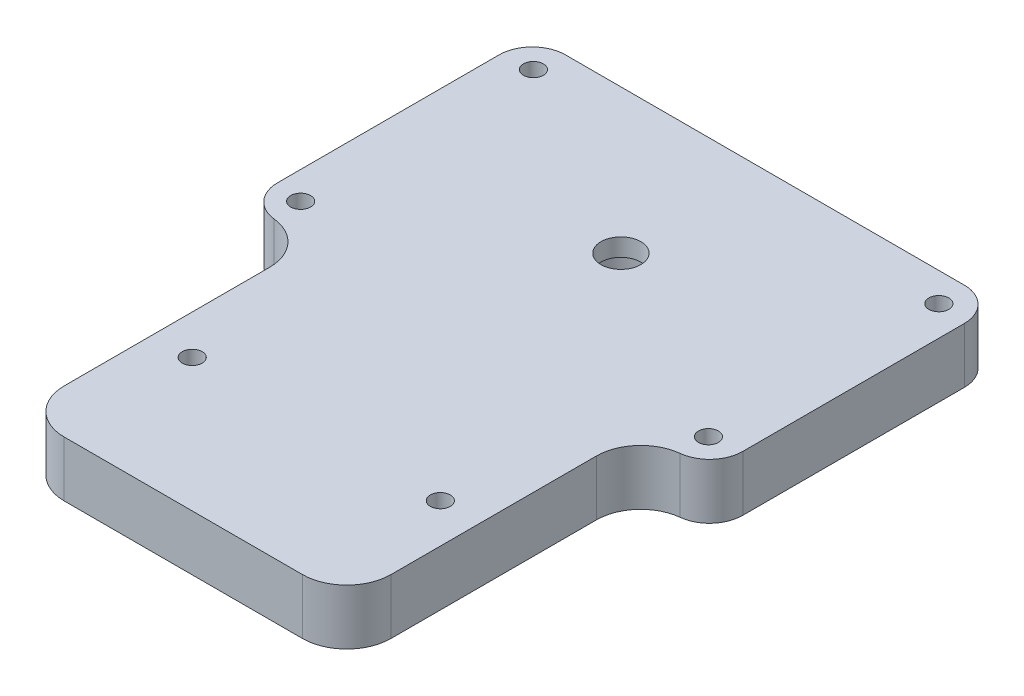
ISO-10303-21;
HEADER;
FILE_DESCRIPTION(('STEP AP214'),'2;1');
FILE_NAME('part.step','',(''),(''),'','','');
FILE_SCHEMA(('AUTOMOTIVE_DESIGN { 1 0 10303 214 1 1 1 1 }'));
ENDSEC;
DATA;
#1=APPLICATION_CONTEXT('core data for automotive mechanical design processes');
#2=APPLICATION_PROTOCOL_DEFINITION('international standard','automotive_design',2000,#1);
#3=PRODUCT_CONTEXT('',#1,'mechanical');
#4=PRODUCT('Part','Part','',(#3));
#5=PRODUCT_RELATED_PRODUCT_CATEGORY('part','',(#4));
#6=PRODUCT_DEFINITION_FORMATION('','',#4);
#7=PRODUCT_DEFINITION_CONTEXT('part definition',#1,'design');
#8=PRODUCT_DEFINITION('design','',#6,#7);
#9=PRODUCT_DEFINITION_SHAPE('','',#8);
#10=(LENGTH_UNIT() NAMED_UNIT(*) SI_UNIT(.MILLI.,.METRE.));
#11=(NAMED_UNIT(*) PLANE_ANGLE_UNIT() SI_UNIT($,.RADIAN.));
#12=(NAMED_UNIT(*) SI_UNIT($,.STERADIAN.) SOLID_ANGLE_UNIT());
#13=UNCERTAINTY_MEASURE_WITH_UNIT(LENGTH_MEASURE(1.E-05),#10,'distance_accuracy_value','');
#14=(GEOMETRIC_REPRESENTATION_CONTEXT(3) GLOBAL_UNCERTAINTY_ASSIGNED_CONTEXT((#13)) GLOBAL_UNIT_ASSIGNED_CONTEXT((#10,
#11,#12)) REPRESENTATION_CONTEXT('',''));
#15=CARTESIAN_POINT('',(0.,0.,0.));
#16=DIRECTION('',(0.,0.,1.));
#17=DIRECTION('',(1.,0.,0.));
#18=AXIS2_PLACEMENT_3D('',#15,#16,#17);
#19=CARTESIAN_POINT('',(-22.86,6.35,-12.7));
#20=DIRECTION('',(0.,1.,0.));
#21=DIRECTION('',(0.,0.,1.));
#22=AXIS2_PLACEMENT_3D('',#19,#20,#21);
#23=PLANE('',#22);
#24=CARTESIAN_POINT('',(0.,6.35,0.));
#25=DIRECTION('',(0.,1.,0.));
#26=DIRECTION('',(0.,0.,1.));
#27=AXIS2_PLACEMENT_3D('',#24,#25,#26);
#28=CIRCLE('',#27,2.286);
#29=CARTESIAN_POINT('',(0.,6.35,2.286));
#30=VERTEX_POINT('',#29);
#31=EDGE_CURVE('E527',#30,#30,#28,.T.);
#32=ORIENTED_EDGE('',*,*,#31,.F.);
#33=EDGE_LOOP('',(#32));
#34=FACE_BOUND('',#33,.T.);
#35=CARTESIAN_POINT('',(14.224,6.35,34.925));
#36=DIRECTION('',(0.,1.,0.));
#37=DIRECTION('',(0.,0.,1.));
#38=AXIS2_PLACEMENT_3D('',#35,#36,#37);
#39=CIRCLE('',#38,1.143);
#40=CARTESIAN_POINT('',(14.224,6.35,36.068));
#41=VERTEX_POINT('',#40);
#42=EDGE_CURVE('E535',#41,#41,#39,.T.);
#43=ORIENTED_EDGE('',*,*,#42,.F.);
#44=EDGE_LOOP('',(#43));
#45=FACE_BOUND('',#44,.T.);
#46=CARTESIAN_POINT('',(23.241,6.35,13.208));
#47=DIRECTION('',(0.,1.,0.));
#48=DIRECTION('',(0.,0.,1.));
#49=AXIS2_PLACEMENT_3D('',#46,#47,#48);
#50=CIRCLE('',#49,1.14299999999999);
#51=CARTESIAN_POINT('',(23.241,6.35,14.351));
#52=VERTEX_POINT('',#51);
#53=EDGE_CURVE('E547',#52,#52,#50,.T.);
#54=ORIENTED_EDGE('',*,*,#53,.F.);
#55=EDGE_LOOP('',(#54));
#56=FACE_BOUND('',#55,.T.);
#57=CARTESIAN_POINT('',(-23.241,6.35,-13.208));
#58=DIRECTION('',(0.,1.,0.));
#59=DIRECTION('',(0.,0.,1.));
#60=AXIS2_PLACEMENT_3D('',#57,#58,#59);
#61=CIRCLE('',#60,1.143);
#62=CARTESIAN_POINT('',(-23.241,6.35,-12.065));
#63=VERTEX_POINT('',#62);
#64=EDGE_CURVE('E238',#63,#63,#61,.T.);
#65=ORIENTED_EDGE('',*,*,#64,.F.);
#66=EDGE_LOOP('',(#65));
#67=FACE_BOUND('',#66,.T.);
#68=DIRECTION('',(1.,0.,0.));
#69=VECTOR('',#68,1.);
#70=CARTESIAN_POINT('',(18.7325,6.35,50.165));
#71=LINE('',#70,#69);
#72=CARTESIAN_POINT('',(-13.6525,6.35,50.165));
#73=VERTEX_POINT('',#72);
#74=CARTESIAN_POINT('',(13.6525,6.35,50.165));
#75=VERTEX_POINT('',#74);
#76=EDGE_CURVE('E229',#73,#75,#71,.T.);
#77=ORIENTED_EDGE('',*,*,#76,.T.);
#78=CARTESIAN_POINT('',(13.6525,6.35,45.085));
#79=DIRECTION('',(0.,1.,0.));
#80=DIRECTION('',(0.,0.,1.));
#81=AXIS2_PLACEMENT_3D('',#78,#79,#80);
#82=CIRCLE('',#81,5.08);
#83=CARTESIAN_POINT('',(18.7325,6.35,45.085));
#84=VERTEX_POINT('',#83);
#85=EDGE_CURVE('E191',#75,#84,#82,.T.);
#86=ORIENTED_EDGE('',*,*,#85,.T.);
#87=DIRECTION('',(0.,0.,-1.));
#88=VECTOR('',#87,1.);
#89=CARTESIAN_POINT('',(18.7325,6.35,16.51));
#90=LINE('',#89,#88);
#91=CARTESIAN_POINT('',(18.7325,6.35,21.5388259259927));
#92=VERTEX_POINT('',#91);
#93=EDGE_CURVE('E220',#84,#92,#90,.T.);
#94=ORIENTED_EDGE('',*,*,#93,.T.);
#95=CARTESIAN_POINT('',(23.8125,6.35,21.5388259259927));
#96=DIRECTION('',(0.,1.,0.));
#97=DIRECTION('',(0.,0.,1.));
#98=AXIS2_PLACEMENT_3D('',#95,#96,#97);
#99=CIRCLE('',#98,5.08);
#100=CARTESIAN_POINT('',(23.2682142857143,6.35,16.4880682539969));
#101=VERTEX_POINT('',#100);
#102=EDGE_CURVE('E11',#92,#101,#99,.F.);
#103=ORIENTED_EDGE('',*,*,#102,.T.);
#104=CARTESIAN_POINT('',(22.86,6.35,12.7));
#105=DIRECTION('',(0.,1.,0.));
#106=DIRECTION('',(0.,0.,1.));
#107=AXIS2_PLACEMENT_3D('',#104,#105,#106);
#108=CIRCLE('',#107,3.81);
#109=CARTESIAN_POINT('',(26.67,6.35,12.7));
#110=VERTEX_POINT('',#109);
#111=EDGE_CURVE('E218',#101,#110,#108,.T.);
#112=ORIENTED_EDGE('',*,*,#111,.T.);
#113=DIRECTION('',(0.,0.,-1.));
#114=VECTOR('',#113,1.);
#115=CARTESIAN_POINT('',(26.67,6.35,-12.7));
#116=LINE('',#115,#114);
#117=CARTESIAN_POINT('',(26.67,6.35,-12.7));
#118=VERTEX_POINT('',#117);
#119=EDGE_CURVE('E225',#110,#118,#116,.T.);
#120=ORIENTED_EDGE('',*,*,#119,.T.);
#121=CARTESIAN_POINT('',(22.86,6.35,-12.7));
#122=DIRECTION('',(0.,1.,0.));
#123=DIRECTION('',(0.,0.,-1.));
#124=AXIS2_PLACEMENT_3D('',#121,#122,#123);
#125=CIRCLE('',#124,3.81);
#126=CARTESIAN_POINT('',(22.86,6.35,-16.51));
#127=VERTEX_POINT('',#126);
#128=EDGE_CURVE('E227',#118,#127,#125,.T.);
#129=ORIENTED_EDGE('',*,*,#128,.T.);
#130=DIRECTION('',(-1.,0.,0.));
#131=VECTOR('',#130,1.);
#132=CARTESIAN_POINT('',(-22.86,6.35,-16.51));
#133=LINE('',#132,#131);
#134=CARTESIAN_POINT('',(-22.86,6.35,-16.51));
#135=VERTEX_POINT('',#134);
#136=EDGE_CURVE('E153',#127,#135,#133,.T.);
#137=ORIENTED_EDGE('',*,*,#136,.T.);
#138=CARTESIAN_POINT('',(-22.86,6.35,-12.7));
#139=DIRECTION('',(0.,1.,0.));
#140=DIRECTION('',(0.,0.,1.));
#141=AXIS2_PLACEMENT_3D('',#138,#139,#140);
#142=CIRCLE('',#141,3.81);
#143=CARTESIAN_POINT('',(-26.67,6.35,-12.7));
#144=VERTEX_POINT('',#143);
#145=EDGE_CURVE('E148',#135,#144,#142,.T.);
#146=ORIENTED_EDGE('',*,*,#145,.T.);
#147=DIRECTION('',(0.,0.,1.));
#148=VECTOR('',#147,1.);
#149=CARTESIAN_POINT('',(-26.67,6.35,-12.7));
#150=LINE('',#149,#148);
#151=CARTESIAN_POINT('',(-26.67,6.35,12.7));
#152=VERTEX_POINT('',#151);
#153=EDGE_CURVE('E137',#144,#152,#150,.T.);
#154=ORIENTED_EDGE('',*,*,#153,.T.);
#155=CARTESIAN_POINT('',(-22.86,6.35,12.7));
#156=DIRECTION('',(0.,1.,0.));
#157=DIRECTION('',(0.,0.,1.));
#158=AXIS2_PLACEMENT_3D('',#155,#156,#157);
#159=CIRCLE('',#158,3.81);
#160=CARTESIAN_POINT('',(-23.2682142857143,6.35,16.4880682539969));
#161=VERTEX_POINT('',#160);
#162=EDGE_CURVE('E147',#152,#161,#159,.T.);
#163=ORIENTED_EDGE('',*,*,#162,.T.);
#164=CARTESIAN_POINT('',(-23.8125,6.35,21.5388259259927));
#165=DIRECTION('',(0.,1.,0.));
#166=DIRECTION('',(0.,0.,1.));
#167=AXIS2_PLACEMENT_3D('',#164,#165,#166);
#168=CIRCLE('',#167,5.08);
#169=CARTESIAN_POINT('',(-18.7325,6.35,21.5388259259927));
#170=VERTEX_POINT('',#169);
#171=EDGE_CURVE('E195',#161,#170,#168,.F.);
#172=ORIENTED_EDGE('',*,*,#171,.T.);
#173=DIRECTION('',(0.,0.,1.));
#174=VECTOR('',#173,1.);
#175=CARTESIAN_POINT('',(-18.7325,6.35,16.51));
#176=LINE('',#175,#174);
#177=CARTESIAN_POINT('',(-18.7325,6.35,45.085));
#178=VERTEX_POINT('',#177);
#179=EDGE_CURVE('E275',#170,#178,#176,.T.);
#180=ORIENTED_EDGE('',*,*,#179,.T.);
#181=CARTESIAN_POINT('',(-13.6525,6.35,45.085));
#182=DIRECTION('',(0.,1.,0.));
#183=DIRECTION('',(0.,0.,1.));
#184=AXIS2_PLACEMENT_3D('',#181,#182,#183);
#185=CIRCLE('',#184,5.08);
#186=EDGE_CURVE('E57',#178,#73,#185,.T.);
#187=ORIENTED_EDGE('',*,*,#186,.T.);
#188=EDGE_LOOP('',(#77,#86,#94,#103,#112,#120,#129,#137,#146,#154,#163,#172,#180,#187));
#189=FACE_BOUND('',#188,.T.);
#190=CARTESIAN_POINT('',(23.241,6.35,-13.208));
#191=DIRECTION('',(0.,1.,0.));
#192=DIRECTION('',(0.,0.,1.));
#193=AXIS2_PLACEMENT_3D('',#190,#191,#192);
#194=CIRCLE('',#193,1.143);
#195=CARTESIAN_POINT('',(23.241,6.35,-12.065));
#196=VERTEX_POINT('',#195);
#197=EDGE_CURVE('E553',#196,#196,#194,.T.);
#198=ORIENTED_EDGE('',*,*,#197,.F.);
#199=EDGE_LOOP('',(#198));
#200=FACE_BOUND('',#199,.T.);
#201=CARTESIAN_POINT('',(-23.5075398103486,6.35,13.208));
#202=DIRECTION('',(0.,1.,0.));
#203=DIRECTION('',(0.,0.,1.));
#204=AXIS2_PLACEMENT_3D('',#201,#202,#203);
#205=CIRCLE('',#204,1.143);
#206=CARTESIAN_POINT('',(-23.5075398103486,6.35,14.351));
#207=VERTEX_POINT('',#206);
#208=EDGE_CURVE('E541',#207,#207,#205,.T.);
#209=ORIENTED_EDGE('',*,*,#208,.F.);
#210=EDGE_LOOP('',(#209));
#211=FACE_BOUND('',#210,.T.);
#212=CARTESIAN_POINT('',(-14.224,6.35,34.925));
#213=DIRECTION('',(0.,1.,0.));
#214=DIRECTION('',(0.,0.,1.));
#215=AXIS2_PLACEMENT_3D('',#212,#213,#214);
#216=CIRCLE('',#215,1.143);
#217=CARTESIAN_POINT('',(-14.224,6.35,36.068));
#218=VERTEX_POINT('',#217);
#219=EDGE_CURVE('E524',#218,#218,#216,.T.);
#220=ORIENTED_EDGE('',*,*,#219,.F.);
#221=EDGE_LOOP('',(#220));
#222=FACE_BOUND('',#221,.T.);
#223=ADVANCED_FACE('F35',(#34,#45,#56,#67,#189,#200,#211,#222),#23,.T.);
#224=CARTESIAN_POINT('',(-22.86,0.,-12.7));
#225=DIRECTION('',(0.,1.,0.));
#226=DIRECTION('',(0.,0.,1.));
#227=AXIS2_PLACEMENT_3D('',#224,#225,#226);
#228=PLANE('',#227);
#229=CARTESIAN_POINT('',(0.,0.,0.));
#230=DIRECTION('',(0.,-1.,0.));
#231=DIRECTION('',(0.,0.,-1.));
#232=AXIS2_PLACEMENT_3D('',#229,#230,#231);
#233=CIRCLE('',#232,3.81);
#234=CARTESIAN_POINT('',(0.,0.,-3.81));
#235=VERTEX_POINT('',#234);
#236=EDGE_CURVE('E521',#235,#235,#233,.T.);
#237=ORIENTED_EDGE('',*,*,#236,.F.);
#238=EDGE_LOOP('',(#237));
#239=FACE_BOUND('',#238,.T.);
#240=DIRECTION('',(0.,0.,-1.));
#241=VECTOR('',#240,1.);
#242=CARTESIAN_POINT('',(18.7325,0.,16.51));
#243=LINE('',#242,#241);
#244=CARTESIAN_POINT('',(18.7325,0.,45.085));
#245=VERTEX_POINT('',#244);
#246=CARTESIAN_POINT('',(18.7325,0.,21.5388259259927));
#247=VERTEX_POINT('',#246);
#248=EDGE_CURVE('E202',#245,#247,#243,.T.);
#249=ORIENTED_EDGE('',*,*,#248,.F.);
#250=CARTESIAN_POINT('',(13.6525,0.,45.085));
#251=DIRECTION('',(0.,1.,0.));
#252=DIRECTION('',(0.,0.,1.));
#253=AXIS2_PLACEMENT_3D('',#250,#251,#252);
#254=CIRCLE('',#253,5.08);
#255=CARTESIAN_POINT('',(13.6525,0.,50.165));
#256=VERTEX_POINT('',#255);
#257=EDGE_CURVE('E184',#245,#256,#254,.F.);
#258=ORIENTED_EDGE('',*,*,#257,.T.);
#259=DIRECTION('',(1.,0.,0.));
#260=VECTOR('',#259,1.);
#261=CARTESIAN_POINT('',(18.7325,0.,50.165));
#262=LINE('',#261,#260);
#263=CARTESIAN_POINT('',(-13.6525,0.,50.165));
#264=VERTEX_POINT('',#263);
#265=EDGE_CURVE('E213',#264,#256,#262,.T.);
#266=ORIENTED_EDGE('',*,*,#265,.F.);
#267=CARTESIAN_POINT('',(-13.6525,0.,45.085));
#268=DIRECTION('',(0.,1.,0.));
#269=DIRECTION('',(0.,0.,1.));
#270=AXIS2_PLACEMENT_3D('',#267,#268,#269);
#271=CIRCLE('',#270,5.08);
#272=CARTESIAN_POINT('',(-18.7325,0.,45.085));
#273=VERTEX_POINT('',#272);
#274=EDGE_CURVE('E182',#264,#273,#271,.F.);
#275=ORIENTED_EDGE('',*,*,#274,.T.);
#276=DIRECTION('',(0.,0.,1.));
#277=VECTOR('',#276,1.);
#278=CARTESIAN_POINT('',(-18.7325,0.,16.51));
#279=LINE('',#278,#277);
#280=CARTESIAN_POINT('',(-18.7325,0.,21.5388259259927));
#281=VERTEX_POINT('',#280);
#282=EDGE_CURVE('E243',#281,#273,#279,.T.);
#283=ORIENTED_EDGE('',*,*,#282,.F.);
#284=CARTESIAN_POINT('',(-23.8125,0.,21.5388259259927));
#285=DIRECTION('',(0.,1.,0.));
#286=DIRECTION('',(0.,0.,1.));
#287=AXIS2_PLACEMENT_3D('',#284,#285,#286);
#288=CIRCLE('',#287,5.08);
#289=CARTESIAN_POINT('',(-23.2682142857143,0.,16.4880682539969));
#290=VERTEX_POINT('',#289);
#291=EDGE_CURVE('E193',#281,#290,#288,.T.);
#292=ORIENTED_EDGE('',*,*,#291,.T.);
#293=CARTESIAN_POINT('',(-22.86,0.,12.7));
#294=DIRECTION('',(0.,1.,0.));
#295=DIRECTION('',(0.,0.,1.));
#296=AXIS2_PLACEMENT_3D('',#293,#294,#295);
#297=CIRCLE('',#296,3.81);
#298=CARTESIAN_POINT('',(-26.67,0.,12.7));
#299=VERTEX_POINT('',#298);
#300=EDGE_CURVE('E240',#299,#290,#297,.T.);
#301=ORIENTED_EDGE('',*,*,#300,.F.);
#302=DIRECTION('',(0.,0.,1.));
#303=VECTOR('',#302,1.);
#304=CARTESIAN_POINT('',(-26.67,0.,-12.7));
#305=LINE('',#304,#303);
#306=CARTESIAN_POINT('',(-26.67,0.,-12.7));
#307=VERTEX_POINT('',#306);
#308=EDGE_CURVE('E237',#307,#299,#305,.T.);
#309=ORIENTED_EDGE('',*,*,#308,.F.);
#310=CARTESIAN_POINT('',(-22.86,0.,-12.7));
#311=DIRECTION('',(0.,1.,0.));
#312=DIRECTION('',(0.,0.,1.));
#313=AXIS2_PLACEMENT_3D('',#310,#311,#312);
#314=CIRCLE('',#313,3.81);
#315=CARTESIAN_POINT('',(-22.86,0.,-16.51));
#316=VERTEX_POINT('',#315);
#317=EDGE_CURVE('E161',#316,#307,#314,.T.);
#318=ORIENTED_EDGE('',*,*,#317,.F.);
#319=DIRECTION('',(-1.,0.,0.));
#320=VECTOR('',#319,1.);
#321=CARTESIAN_POINT('',(-22.86,0.,-16.51));
#322=LINE('',#321,#320);
#323=CARTESIAN_POINT('',(22.86,0.,-16.51));
#324=VERTEX_POINT('',#323);
#325=EDGE_CURVE('E157',#324,#316,#322,.T.);
#326=ORIENTED_EDGE('',*,*,#325,.F.);
#327=CARTESIAN_POINT('',(22.86,0.,-12.7));
#328=DIRECTION('',(0.,1.,0.));
#329=DIRECTION('',(0.,0.,-1.));
#330=AXIS2_PLACEMENT_3D('',#327,#328,#329);
#331=CIRCLE('',#330,3.81);
#332=CARTESIAN_POINT('',(26.67,0.,-12.7));
#333=VERTEX_POINT('',#332);
#334=EDGE_CURVE('E250',#333,#324,#331,.T.);
#335=ORIENTED_EDGE('',*,*,#334,.F.);
#336=DIRECTION('',(0.,0.,-1.));
#337=VECTOR('',#336,1.);
#338=CARTESIAN_POINT('',(26.67,0.,-12.7));
#339=LINE('',#338,#337);
#340=CARTESIAN_POINT('',(26.67,0.,12.7));
#341=VERTEX_POINT('',#340);
#342=EDGE_CURVE('E248',#341,#333,#339,.T.);
#343=ORIENTED_EDGE('',*,*,#342,.F.);
#344=CARTESIAN_POINT('',(22.86,0.,12.7));
#345=DIRECTION('',(0.,1.,0.));
#346=DIRECTION('',(0.,0.,1.));
#347=AXIS2_PLACEMENT_3D('',#344,#345,#346);
#348=CIRCLE('',#347,3.81);
#349=CARTESIAN_POINT('',(23.2682142857143,0.,16.4880682539969));
#350=VERTEX_POINT('',#349);
#351=EDGE_CURVE('E204',#350,#341,#348,.T.);
#352=ORIENTED_EDGE('',*,*,#351,.F.);
#353=CARTESIAN_POINT('',(23.8125,0.,21.5388259259927));
#354=DIRECTION('',(0.,1.,0.));
#355=DIRECTION('',(0.,0.,1.));
#356=AXIS2_PLACEMENT_3D('',#353,#354,#355);
#357=CIRCLE('',#356,5.08);
#358=EDGE_CURVE('E43',#350,#247,#357,.T.);
#359=ORIENTED_EDGE('',*,*,#358,.T.);
#360=EDGE_LOOP('',(#249,#258,#266,#275,#283,#292,#301,#309,#318,#326,#335,#343,#352,#359));
#361=FACE_BOUND('',#360,.T.);
#362=CARTESIAN_POINT('',(-23.241,0.,-13.208));
#363=DIRECTION('',(0.,1.,0.));
#364=DIRECTION('',(0.,0.,1.));
#365=AXIS2_PLACEMENT_3D('',#362,#363,#364);
#366=CIRCLE('',#365,1.143);
#367=CARTESIAN_POINT('',(-23.241,0.,-12.065));
#368=VERTEX_POINT('',#367);
#369=EDGE_CURVE('E556',#368,#368,#366,.T.);
#370=ORIENTED_EDGE('',*,*,#369,.T.);
#371=EDGE_LOOP('',(#370));
#372=FACE_BOUND('',#371,.T.);
#373=CARTESIAN_POINT('',(23.241,0.,-13.208));
#374=DIRECTION('',(0.,1.,0.));
#375=DIRECTION('',(0.,0.,1.));
#376=AXIS2_PLACEMENT_3D('',#373,#374,#375);
#377=CIRCLE('',#376,1.143);
#378=CARTESIAN_POINT('',(23.241,0.,-12.065));
#379=VERTEX_POINT('',#378);
#380=EDGE_CURVE('E550',#379,#379,#377,.T.);
#381=ORIENTED_EDGE('',*,*,#380,.T.);
#382=EDGE_LOOP('',(#381));
#383=FACE_BOUND('',#382,.T.);
#384=CARTESIAN_POINT('',(23.241,0.,13.208));
#385=DIRECTION('',(0.,1.,0.));
#386=DIRECTION('',(0.,0.,1.));
#387=AXIS2_PLACEMENT_3D('',#384,#385,#386);
#388=CIRCLE('',#387,1.14299999999999);
#389=CARTESIAN_POINT('',(23.241,0.,14.351));
#390=VERTEX_POINT('',#389);
#391=EDGE_CURVE('E544',#390,#390,#388,.T.);
#392=ORIENTED_EDGE('',*,*,#391,.T.);
#393=EDGE_LOOP('',(#392));
#394=FACE_BOUND('',#393,.T.);
#395=CARTESIAN_POINT('',(-23.5075398103486,0.,13.208));
#396=DIRECTION('',(0.,1.,0.));
#397=DIRECTION('',(0.,0.,1.));
#398=AXIS2_PLACEMENT_3D('',#395,#396,#397);
#399=CIRCLE('',#398,1.143);
#400=CARTESIAN_POINT('',(-23.5075398103486,0.,14.351));
#401=VERTEX_POINT('',#400);
#402=EDGE_CURVE('E538',#401,#401,#399,.T.);
#403=ORIENTED_EDGE('',*,*,#402,.T.);
#404=EDGE_LOOP('',(#403));
#405=FACE_BOUND('',#404,.T.);
#406=CARTESIAN_POINT('',(14.224,0.,34.925));
#407=DIRECTION('',(0.,1.,0.));
#408=DIRECTION('',(0.,0.,1.));
#409=AXIS2_PLACEMENT_3D('',#406,#407,#408);
#410=CIRCLE('',#409,1.143);
#411=CARTESIAN_POINT('',(14.224,0.,36.068));
#412=VERTEX_POINT('',#411);
#413=EDGE_CURVE('E533',#412,#412,#410,.T.);
#414=ORIENTED_EDGE('',*,*,#413,.T.);
#415=EDGE_LOOP('',(#414));
#416=FACE_BOUND('',#415,.T.);
#417=CARTESIAN_POINT('',(-14.224,0.,34.925));
#418=DIRECTION('',(0.,1.,0.));
#419=DIRECTION('',(0.,0.,1.));
#420=AXIS2_PLACEMENT_3D('',#417,#418,#419);
#421=CIRCLE('',#420,1.143);
#422=CARTESIAN_POINT('',(-14.224,0.,36.068));
#423=VERTEX_POINT('',#422);
#424=EDGE_CURVE('E520',#423,#423,#421,.T.);
#425=ORIENTED_EDGE('',*,*,#424,.T.);
#426=EDGE_LOOP('',(#425));
#427=FACE_BOUND('',#426,.T.);
#428=ADVANCED_FACE('F200',(#239,#361,#372,#383,#394,#405,#416,#427),#228,.F.);
#429=CARTESIAN_POINT('',(-22.86,6.35,-12.7));
#430=DIRECTION('',(0.,-1.,0.));
#431=DIRECTION('',(0.,0.,-1.));
#432=AXIS2_PLACEMENT_3D('',#429,#430,#431);
#433=CYLINDRICAL_SURFACE('',#432,3.81);
#434=ORIENTED_EDGE('',*,*,#317,.T.);
#435=DIRECTION('',(0.,-1.,0.));
#436=VECTOR('',#435,1.);
#437=CARTESIAN_POINT('',(-26.67,6.35,-12.7));
#438=LINE('',#437,#436);
#439=EDGE_CURVE('E141',#144,#307,#438,.T.);
#440=ORIENTED_EDGE('',*,*,#439,.F.);
#441=ORIENTED_EDGE('',*,*,#145,.F.);
#442=DIRECTION('',(0.,-1.,0.));
#443=VECTOR('',#442,1.);
#444=CARTESIAN_POINT('',(-22.86,6.35,-16.51));
#445=LINE('',#444,#443);
#446=EDGE_CURVE('E235',#135,#316,#445,.T.);
#447=ORIENTED_EDGE('',*,*,#446,.T.);
#448=EDGE_LOOP('',(#434,#440,#441,#447));
#449=FACE_BOUND('',#448,.T.);
#450=ADVANCED_FACE('F159',(#449),#433,.T.);
#451=CARTESIAN_POINT('',(-26.67,6.35,-12.7));
#452=DIRECTION('',(1.,0.,0.));
#453=DIRECTION('',(0.,0.,-1.));
#454=AXIS2_PLACEMENT_3D('',#451,#452,#453);
#455=PLANE('',#454);
#456=ORIENTED_EDGE('',*,*,#308,.T.);
#457=DIRECTION('',(0.,-1.,0.));
#458=VECTOR('',#457,1.);
#459=CARTESIAN_POINT('',(-26.67,6.35,12.7));
#460=LINE('',#459,#458);
#461=EDGE_CURVE('E144',#152,#299,#460,.T.);
#462=ORIENTED_EDGE('',*,*,#461,.F.);
#463=ORIENTED_EDGE('',*,*,#153,.F.);
#464=ORIENTED_EDGE('',*,*,#439,.T.);
#465=EDGE_LOOP('',(#456,#462,#463,#464));
#466=FACE_BOUND('',#465,.T.);
#467=ADVANCED_FACE('F139',(#466),#455,.F.);
#468=CARTESIAN_POINT('',(-22.86,6.35,12.7));
#469=DIRECTION('',(0.,-1.,0.));
#470=DIRECTION('',(0.,0.,-1.));
#471=AXIS2_PLACEMENT_3D('',#468,#469,#470);
#472=CYLINDRICAL_SURFACE('',#471,3.81);
#473=ORIENTED_EDGE('',*,*,#300,.T.);
#474=DIRECTION('',(0.,-1.,0.));
#475=VECTOR('',#474,1.);
#476=CARTESIAN_POINT('',(-23.2682142857143,6.35,16.4880682539969));
#477=LINE('',#476,#475);
#478=EDGE_CURVE('E172',#290,#161,#477,.F.);
#479=ORIENTED_EDGE('',*,*,#478,.T.);
#480=ORIENTED_EDGE('',*,*,#162,.F.);
#481=ORIENTED_EDGE('',*,*,#461,.T.);
#482=EDGE_LOOP('',(#473,#479,#480,#481));
#483=FACE_BOUND('',#482,.T.);
#484=ADVANCED_FACE('F272',(#483),#472,.T.);
#485=CARTESIAN_POINT('',(-18.7325,6.35,16.51));
#486=DIRECTION('',(1.,0.,0.));
#487=DIRECTION('',(0.,0.,-1.));
#488=AXIS2_PLACEMENT_3D('',#485,#486,#487);
#489=PLANE('',#488);
#490=ORIENTED_EDGE('',*,*,#179,.F.);
#491=DIRECTION('',(0.,1.,0.));
#492=VECTOR('',#491,1.);
#493=CARTESIAN_POINT('',(-18.7325,0.,21.5388259259927));
#494=LINE('',#493,#492);
#495=EDGE_CURVE('E164',#170,#281,#494,.F.);
#496=ORIENTED_EDGE('',*,*,#495,.T.);
#497=ORIENTED_EDGE('',*,*,#282,.T.);
#498=DIRECTION('',(0.,-1.,0.));
#499=VECTOR('',#498,1.);
#500=CARTESIAN_POINT('',(-18.7325,6.35,45.085));
#501=LINE('',#500,#499);
#502=EDGE_CURVE('E162',#273,#178,#501,.F.);
#503=ORIENTED_EDGE('',*,*,#502,.T.);
#504=EDGE_LOOP('',(#490,#496,#497,#503));
#505=FACE_BOUND('',#504,.T.);
#506=ADVANCED_FACE('F289',(#505),#489,.F.);
#507=CARTESIAN_POINT('',(18.7325,6.35,50.165));
#508=DIRECTION('',(0.,0.,-1.));
#509=DIRECTION('',(-1.,0.,0.));
#510=AXIS2_PLACEMENT_3D('',#507,#508,#509);
#511=PLANE('',#510);
#512=ORIENTED_EDGE('',*,*,#265,.T.);
#513=DIRECTION('',(0.,-1.,0.));
#514=VECTOR('',#513,1.);
#515=CARTESIAN_POINT('',(13.6525,6.35,50.165));
#516=LINE('',#515,#514);
#517=EDGE_CURVE('E50',#256,#75,#516,.F.);
#518=ORIENTED_EDGE('',*,*,#517,.T.);
#519=ORIENTED_EDGE('',*,*,#76,.F.);
#520=DIRECTION('',(0.,-1.,0.));
#521=VECTOR('',#520,1.);
#522=CARTESIAN_POINT('',(-13.6525,6.35,50.165));
#523=LINE('',#522,#521);
#524=EDGE_CURVE('E186',#73,#264,#523,.T.);
#525=ORIENTED_EDGE('',*,*,#524,.T.);
#526=EDGE_LOOP('',(#512,#518,#519,#525));
#527=FACE_BOUND('',#526,.T.);
#528=ADVANCED_FACE('F283',(#527),#511,.F.);
#529=CARTESIAN_POINT('',(18.7325,6.35,16.51));
#530=DIRECTION('',(-1.,0.,0.));
#531=DIRECTION('',(0.,0.,1.));
#532=AXIS2_PLACEMENT_3D('',#529,#530,#531);
#533=PLANE('',#532);
#534=ORIENTED_EDGE('',*,*,#248,.T.);
#535=DIRECTION('',(0.,1.,0.));
#536=VECTOR('',#535,1.);
#537=CARTESIAN_POINT('',(18.7325,6.35,21.5388259259927));
#538=LINE('',#537,#536);
#539=EDGE_CURVE('E180',#247,#92,#538,.T.);
#540=ORIENTED_EDGE('',*,*,#539,.T.);
#541=ORIENTED_EDGE('',*,*,#93,.F.);
#542=DIRECTION('',(0.,-1.,0.));
#543=VECTOR('',#542,1.);
#544=CARTESIAN_POINT('',(18.7325,6.35,45.085));
#545=LINE('',#544,#543);
#546=EDGE_CURVE('E177',#84,#245,#545,.T.);
#547=ORIENTED_EDGE('',*,*,#546,.T.);
#548=EDGE_LOOP('',(#534,#540,#541,#547));
#549=FACE_BOUND('',#548,.T.);
#550=ADVANCED_FACE('F209',(#549),#533,.F.);
#551=CARTESIAN_POINT('',(22.86,6.35,12.7));
#552=DIRECTION('',(0.,-1.,0.));
#553=DIRECTION('',(0.,0.,-1.));
#554=AXIS2_PLACEMENT_3D('',#551,#552,#553);
#555=CYLINDRICAL_SURFACE('',#554,3.81);
#556=ORIENTED_EDGE('',*,*,#111,.F.);
#557=DIRECTION('',(0.,-1.,0.));
#558=VECTOR('',#557,1.);
#559=CARTESIAN_POINT('',(23.2682142857143,6.35,16.4880682539969));
#560=LINE('',#559,#558);
#561=EDGE_CURVE('E174',#101,#350,#560,.T.);
#562=ORIENTED_EDGE('',*,*,#561,.T.);
#563=ORIENTED_EDGE('',*,*,#351,.T.);
#564=DIRECTION('',(0.,-1.,0.));
#565=VECTOR('',#564,1.);
#566=CARTESIAN_POINT('',(26.67,6.35,12.7));
#567=LINE('',#566,#565);
#568=EDGE_CURVE('E166',#110,#341,#567,.T.);
#569=ORIENTED_EDGE('',*,*,#568,.F.);
#570=EDGE_LOOP('',(#556,#562,#563,#569));
#571=FACE_BOUND('',#570,.T.);
#572=ADVANCED_FACE('F222',(#571),#555,.T.);
#573=CARTESIAN_POINT('',(26.67,6.35,-12.7));
#574=DIRECTION('',(-1.,0.,0.));
#575=DIRECTION('',(0.,0.,1.));
#576=AXIS2_PLACEMENT_3D('',#573,#574,#575);
#577=PLANE('',#576);
#578=ORIENTED_EDGE('',*,*,#342,.T.);
#579=DIRECTION('',(0.,-1.,0.));
#580=VECTOR('',#579,1.);
#581=CARTESIAN_POINT('',(26.67,6.35,-12.7));
#582=LINE('',#581,#580);
#583=EDGE_CURVE('E257',#118,#333,#582,.T.);
#584=ORIENTED_EDGE('',*,*,#583,.F.);
#585=ORIENTED_EDGE('',*,*,#119,.F.);
#586=ORIENTED_EDGE('',*,*,#568,.T.);
#587=EDGE_LOOP('',(#578,#584,#585,#586));
#588=FACE_BOUND('',#587,.T.);
#589=ADVANCED_FACE('F260',(#588),#577,.F.);
#590=CARTESIAN_POINT('',(22.86,6.35,-12.7));
#591=DIRECTION('',(0.,-1.,0.));
#592=DIRECTION('',(0.,0.,-1.));
#593=AXIS2_PLACEMENT_3D('',#590,#591,#592);
#594=CYLINDRICAL_SURFACE('',#593,3.81);
#595=ORIENTED_EDGE('',*,*,#334,.T.);
#596=DIRECTION('',(0.,-1.,0.));
#597=VECTOR('',#596,1.);
#598=CARTESIAN_POINT('',(22.86,6.35,-16.51));
#599=LINE('',#598,#597);
#600=EDGE_CURVE('E254',#127,#324,#599,.T.);
#601=ORIENTED_EDGE('',*,*,#600,.F.);
#602=ORIENTED_EDGE('',*,*,#128,.F.);
#603=ORIENTED_EDGE('',*,*,#583,.T.);
#604=EDGE_LOOP('',(#595,#601,#602,#603));
#605=FACE_BOUND('',#604,.T.);
#606=ADVANCED_FACE('F266',(#605),#594,.T.);
#607=CARTESIAN_POINT('',(-22.86,6.35,-16.51));
#608=DIRECTION('',(0.,0.,1.));
#609=DIRECTION('',(1.,0.,0.));
#610=AXIS2_PLACEMENT_3D('',#607,#608,#609);
#611=PLANE('',#610);
#612=ORIENTED_EDGE('',*,*,#325,.T.);
#613=ORIENTED_EDGE('',*,*,#446,.F.);
#614=ORIENTED_EDGE('',*,*,#136,.F.);
#615=ORIENTED_EDGE('',*,*,#600,.T.);
#616=EDGE_LOOP('',(#612,#613,#614,#615));
#617=FACE_BOUND('',#616,.T.);
#618=ADVANCED_FACE('F269',(#617),#611,.F.);
#619=CARTESIAN_POINT('',(-23.241,6.35,-13.208));
#620=DIRECTION('',(0.,-1.,0.));
#621=DIRECTION('',(0.,0.,-1.));
#622=AXIS2_PLACEMENT_3D('',#619,#620,#621);
#623=CYLINDRICAL_SURFACE('',#622,1.143);
#624=ORIENTED_EDGE('',*,*,#64,.T.);
#625=EDGE_LOOP('',(#624));
#626=FACE_BOUND('',#625,.T.);
#627=ORIENTED_EDGE('',*,*,#369,.F.);
#628=EDGE_LOOP('',(#627));
#629=FACE_BOUND('',#628,.T.);
#630=ADVANCED_FACE('F316',(#626,#629),#623,.F.);
#631=CARTESIAN_POINT('',(23.241,6.35,-13.208));
#632=DIRECTION('',(0.,-1.,0.));
#633=DIRECTION('',(0.,0.,-1.));
#634=AXIS2_PLACEMENT_3D('',#631,#632,#633);
#635=CYLINDRICAL_SURFACE('',#634,1.143);
#636=ORIENTED_EDGE('',*,*,#197,.T.);
#637=EDGE_LOOP('',(#636));
#638=FACE_BOUND('',#637,.T.);
#639=ORIENTED_EDGE('',*,*,#380,.F.);
#640=EDGE_LOOP('',(#639));
#641=FACE_BOUND('',#640,.T.);
#642=ADVANCED_FACE('F383',(#638,#641),#635,.F.);
#643=CARTESIAN_POINT('',(23.241,6.35,13.208));
#644=DIRECTION('',(0.,-1.,0.));
#645=DIRECTION('',(0.,0.,-1.));
#646=AXIS2_PLACEMENT_3D('',#643,#644,#645);
#647=CYLINDRICAL_SURFACE('',#646,1.14299999999999);
#648=ORIENTED_EDGE('',*,*,#53,.T.);
#649=EDGE_LOOP('',(#648));
#650=FACE_BOUND('',#649,.T.);
#651=ORIENTED_EDGE('',*,*,#391,.F.);
#652=EDGE_LOOP('',(#651));
#653=FACE_BOUND('',#652,.T.);
#654=ADVANCED_FACE('F390',(#650,#653),#647,.F.);
#655=CARTESIAN_POINT('',(-23.5075398103486,6.35,13.208));
#656=DIRECTION('',(0.,-1.,0.));
#657=DIRECTION('',(0.,0.,-1.));
#658=AXIS2_PLACEMENT_3D('',#655,#656,#657);
#659=CYLINDRICAL_SURFACE('',#658,1.143);
#660=ORIENTED_EDGE('',*,*,#208,.T.);
#661=EDGE_LOOP('',(#660));
#662=FACE_BOUND('',#661,.T.);
#663=ORIENTED_EDGE('',*,*,#402,.F.);
#664=EDGE_LOOP('',(#663));
#665=FACE_BOUND('',#664,.T.);
#666=ADVANCED_FACE('F397',(#662,#665),#659,.F.);
#667=CARTESIAN_POINT('',(14.224,6.35,34.925));
#668=DIRECTION('',(0.,-1.,0.));
#669=DIRECTION('',(0.,0.,-1.));
#670=AXIS2_PLACEMENT_3D('',#667,#668,#669);
#671=CYLINDRICAL_SURFACE('',#670,1.143);
#672=ORIENTED_EDGE('',*,*,#42,.T.);
#673=EDGE_LOOP('',(#672));
#674=FACE_BOUND('',#673,.T.);
#675=ORIENTED_EDGE('',*,*,#413,.F.);
#676=EDGE_LOOP('',(#675));
#677=FACE_BOUND('',#676,.T.);
#678=ADVANCED_FACE('F405',(#674,#677),#671,.F.);
#679=CARTESIAN_POINT('',(-14.224,6.35,34.925));
#680=DIRECTION('',(0.,-1.,0.));
#681=DIRECTION('',(0.,0.,-1.));
#682=AXIS2_PLACEMENT_3D('',#679,#680,#681);
#683=CYLINDRICAL_SURFACE('',#682,1.143);
#684=ORIENTED_EDGE('',*,*,#219,.T.);
#685=EDGE_LOOP('',(#684));
#686=FACE_BOUND('',#685,.T.);
#687=ORIENTED_EDGE('',*,*,#424,.F.);
#688=EDGE_LOOP('',(#687));
#689=FACE_BOUND('',#688,.T.);
#690=ADVANCED_FACE('F413',(#686,#689),#683,.F.);
#691=CARTESIAN_POINT('',(0.,4.318,0.));
#692=DIRECTION('',(0.,-1.,0.));
#693=DIRECTION('',(0.,0.,-1.));
#694=AXIS2_PLACEMENT_3D('',#691,#692,#693);
#695=CYLINDRICAL_SURFACE('',#694,3.81);
#696=CARTESIAN_POINT('',(0.,4.318,0.));
#697=DIRECTION('',(0.,-1.,0.));
#698=DIRECTION('',(0.,0.,-1.));
#699=AXIS2_PLACEMENT_3D('',#696,#697,#698);
#700=CIRCLE('',#699,3.81);
#701=CARTESIAN_POINT('',(0.,4.318,-3.81));
#702=VERTEX_POINT('',#701);
#703=EDGE_CURVE('E519',#702,#702,#700,.T.);
#704=ORIENTED_EDGE('',*,*,#703,.F.);
#705=EDGE_LOOP('',(#704));
#706=FACE_BOUND('',#705,.T.);
#707=ORIENTED_EDGE('',*,*,#236,.T.);
#708=EDGE_LOOP('',(#707));
#709=FACE_BOUND('',#708,.T.);
#710=ADVANCED_FACE('F421',(#706,#709),#695,.F.);
#711=CARTESIAN_POINT('',(0.,4.318,0.));
#712=DIRECTION('',(0.,-1.,0.));
#713=DIRECTION('',(0.,0.,-1.));
#714=AXIS2_PLACEMENT_3D('',#711,#712,#713);
#715=PLANE('',#714);
#716=CARTESIAN_POINT('',(0.,4.318,0.));
#717=DIRECTION('',(0.,-1.,0.));
#718=DIRECTION('',(0.,0.,-1.));
#719=AXIS2_PLACEMENT_3D('',#716,#717,#718);
#720=CIRCLE('',#719,2.286);
#721=CARTESIAN_POINT('',(0.,4.318,-2.286));
#722=VERTEX_POINT('',#721);
#723=EDGE_CURVE('E516',#722,#722,#720,.T.);
#724=ORIENTED_EDGE('',*,*,#723,.F.);
#725=EDGE_LOOP('',(#724));
#726=FACE_BOUND('',#725,.T.);
#727=ORIENTED_EDGE('',*,*,#703,.T.);
#728=EDGE_LOOP('',(#727));
#729=FACE_BOUND('',#728,.T.);
#730=ADVANCED_FACE('F301',(#726,#729),#715,.T.);
#731=CARTESIAN_POINT('',(0.,8.636,0.));
#732=DIRECTION('',(0.,-1.,0.));
#733=DIRECTION('',(0.,0.,-1.));
#734=AXIS2_PLACEMENT_3D('',#731,#732,#733);
#735=CYLINDRICAL_SURFACE('',#734,2.286);
#736=ORIENTED_EDGE('',*,*,#31,.T.);
#737=EDGE_LOOP('',(#736));
#738=FACE_BOUND('',#737,.T.);
#739=ORIENTED_EDGE('',*,*,#723,.T.);
#740=EDGE_LOOP('',(#739));
#741=FACE_BOUND('',#740,.T.);
#742=ADVANCED_FACE('F294',(#738,#741),#735,.F.);
#743=CARTESIAN_POINT('',(-23.8125,6.35,21.5388259259927));
#744=DIRECTION('',(0.,-1.,0.));
#745=DIRECTION('',(0.,0.,-1.));
#746=AXIS2_PLACEMENT_3D('',#743,#744,#745);
#747=CYLINDRICAL_SURFACE('',#746,5.08);
#748=ORIENTED_EDGE('',*,*,#171,.F.);
#749=ORIENTED_EDGE('',*,*,#478,.F.);
#750=ORIENTED_EDGE('',*,*,#291,.F.);
#751=ORIENTED_EDGE('',*,*,#495,.F.);
#752=EDGE_LOOP('',(#748,#749,#750,#751));
#753=FACE_BOUND('',#752,.T.);
#754=ADVANCED_FACE('F292',(#753),#747,.F.);
#755=CARTESIAN_POINT('',(23.8125,6.35,21.5388259259927));
#756=DIRECTION('',(0.,-1.,0.));
#757=DIRECTION('',(0.,0.,-1.));
#758=AXIS2_PLACEMENT_3D('',#755,#756,#757);
#759=CYLINDRICAL_SURFACE('',#758,5.08);
#760=ORIENTED_EDGE('',*,*,#102,.F.);
#761=ORIENTED_EDGE('',*,*,#539,.F.);
#762=ORIENTED_EDGE('',*,*,#358,.F.);
#763=ORIENTED_EDGE('',*,*,#561,.F.);
#764=EDGE_LOOP('',(#760,#761,#762,#763));
#765=FACE_BOUND('',#764,.T.);
#766=ADVANCED_FACE('F216',(#765),#759,.F.);
#767=CARTESIAN_POINT('',(13.6525,6.35,45.085));
#768=DIRECTION('',(0.,-1.,0.));
#769=DIRECTION('',(0.,0.,-1.));
#770=AXIS2_PLACEMENT_3D('',#767,#768,#769);
#771=CYLINDRICAL_SURFACE('',#770,5.08);
#772=ORIENTED_EDGE('',*,*,#85,.F.);
#773=ORIENTED_EDGE('',*,*,#517,.F.);
#774=ORIENTED_EDGE('',*,*,#257,.F.);
#775=ORIENTED_EDGE('',*,*,#546,.F.);
#776=EDGE_LOOP('',(#772,#773,#774,#775));
#777=FACE_BOUND('',#776,.T.);
#778=ADVANCED_FACE('F281',(#777),#771,.T.);
#779=CARTESIAN_POINT('',(-13.6525,6.35,45.085));
#780=DIRECTION('',(0.,-1.,0.));
#781=DIRECTION('',(0.,0.,-1.));
#782=AXIS2_PLACEMENT_3D('',#779,#780,#781);
#783=CYLINDRICAL_SURFACE('',#782,5.08);
#784=ORIENTED_EDGE('',*,*,#186,.F.);
#785=ORIENTED_EDGE('',*,*,#502,.F.);
#786=ORIENTED_EDGE('',*,*,#274,.F.);
#787=ORIENTED_EDGE('',*,*,#524,.F.);
#788=EDGE_LOOP('',(#784,#785,#786,#787));
#789=FACE_BOUND('',#788,.T.);
#790=ADVANCED_FACE('F37',(#789),#783,.T.);
#791=CLOSED_SHELL('',(#223,#428,#450,#467,#484,#506,#528,#550,#572,#589,#606,#618,#630,#642,
#654,#666,#678,#690,#710,#730,#742,#754,#766,#778,#790));
#792=MANIFOLD_SOLID_BREP('B2',#791);
#793=ADVANCED_BREP_SHAPE_REPRESENTATION('',(#18,#792),#14);
#794=SHAPE_DEFINITION_REPRESENTATION(#9,#793);
ENDSEC;
END-ISO-10303-21;
